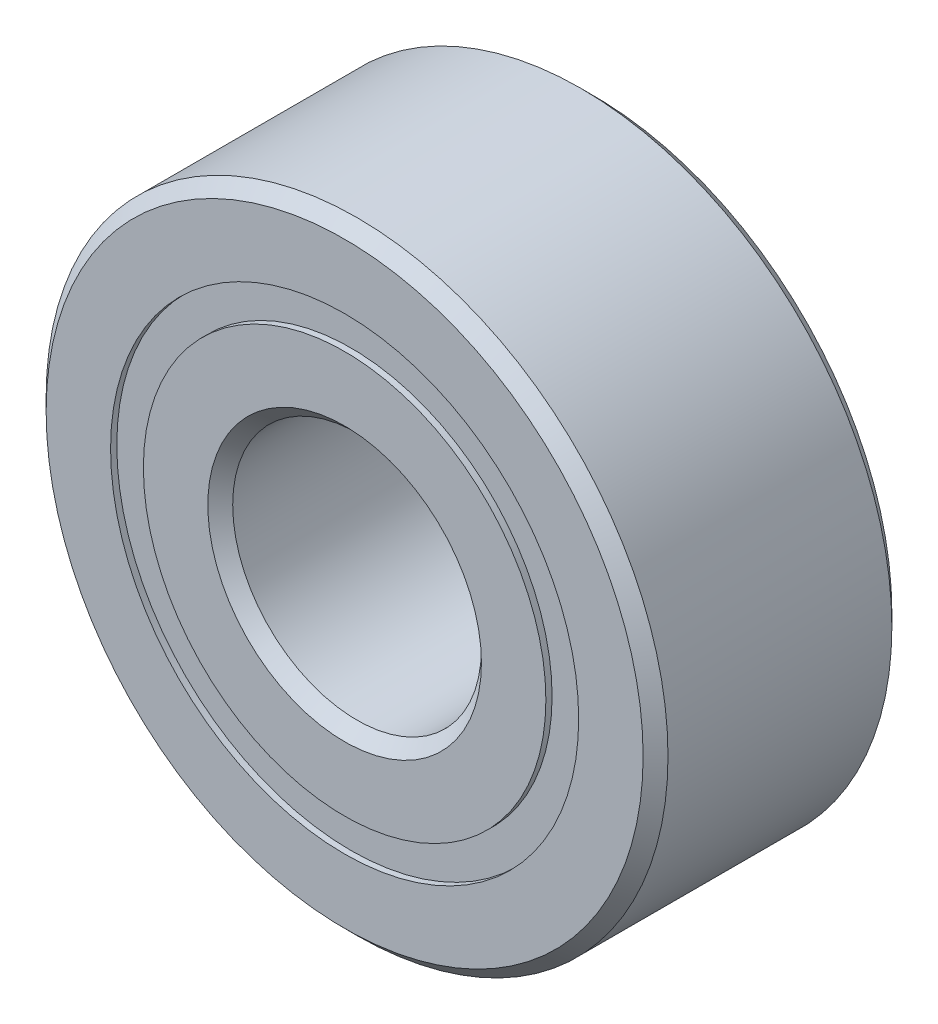
ISO-10303-21;
HEADER;
FILE_DESCRIPTION(('STEP AP214'),'2;1');
FILE_NAME('part.step','',(''),(''),'','','');
FILE_SCHEMA(('AUTOMOTIVE_DESIGN { 1 0 10303 214 1 1 1 1 }'));
ENDSEC;
DATA;
#1=APPLICATION_CONTEXT('core data for automotive mechanical design processes');
#2=APPLICATION_PROTOCOL_DEFINITION('international standard','automotive_design',2000,#1);
#3=PRODUCT_CONTEXT('',#1,'mechanical');
#4=PRODUCT('Part','Part','',(#3));
#5=PRODUCT_RELATED_PRODUCT_CATEGORY('part','',(#4));
#6=PRODUCT_DEFINITION_FORMATION('','',#4);
#7=PRODUCT_DEFINITION_CONTEXT('part definition',#1,'design');
#8=PRODUCT_DEFINITION('design','',#6,#7);
#9=PRODUCT_DEFINITION_SHAPE('','',#8);
#10=(LENGTH_UNIT() NAMED_UNIT(*) SI_UNIT(.MILLI.,.METRE.));
#11=(NAMED_UNIT(*) PLANE_ANGLE_UNIT() SI_UNIT($,.RADIAN.));
#12=(NAMED_UNIT(*) SI_UNIT($,.STERADIAN.) SOLID_ANGLE_UNIT());
#13=UNCERTAINTY_MEASURE_WITH_UNIT(LENGTH_MEASURE(1.E-05),#10,'distance_accuracy_value','');
#14=(GEOMETRIC_REPRESENTATION_CONTEXT(3) GLOBAL_UNCERTAINTY_ASSIGNED_CONTEXT((#13)) GLOBAL_UNIT_ASSIGNED_CONTEXT((#10,
#11,#12)) REPRESENTATION_CONTEXT('',''));
#15=CARTESIAN_POINT('',(0.,0.,0.));
#16=DIRECTION('',(0.,0.,1.));
#17=DIRECTION('',(1.,0.,0.));
#18=AXIS2_PLACEMENT_3D('',#15,#16,#17);
#19=CARTESIAN_POINT('',(0.,3.76373626373626,-1.9));
#20=DIRECTION('',(0.,0.,1.));
#21=DIRECTION('',(1.,0.,0.));
#22=AXIS2_PLACEMENT_3D('',#19,#20,#21);
#23=PLANE('',#22);
#24=CARTESIAN_POINT('',(0.,0.,-1.9));
#25=DIRECTION('',(0.,0.,1.));
#26=DIRECTION('',(1.,0.,0.));
#27=AXIS2_PLACEMENT_3D('',#24,#25,#26);
#28=CIRCLE('',#27,3.76373626373626);
#29=CARTESIAN_POINT('',(3.76373626373626,0.,-1.9));
#30=VERTEX_POINT('',#29);
#31=EDGE_CURVE('E70',#30,#30,#28,.T.);
#32=ORIENTED_EDGE('',*,*,#31,.F.);
#33=EDGE_LOOP('',(#32));
#34=FACE_BOUND('',#33,.T.);
#35=CARTESIAN_POINT('',(0.,0.,-1.9));
#36=DIRECTION('',(0.,0.,1.));
#37=DIRECTION('',(1.,0.,0.));
#38=AXIS2_PLACEMENT_3D('',#35,#36,#37);
#39=CIRCLE('',#38,3.23626373626374);
#40=CARTESIAN_POINT('',(3.23626373626374,0.,-1.9));
#41=VERTEX_POINT('',#40);
#42=EDGE_CURVE('E11',#41,#41,#39,.T.);
#43=ORIENTED_EDGE('',*,*,#42,.T.);
#44=EDGE_LOOP('',(#43));
#45=FACE_BOUND('',#44,.T.);
#46=ADVANCED_FACE('F50',(#34,#45),#23,.F.);
#47=CARTESIAN_POINT('',(0.,0.,2.));
#48=DIRECTION('',(0.,0.,1.));
#49=DIRECTION('',(1.,0.,0.));
#50=AXIS2_PLACEMENT_3D('',#47,#48,#49);
#51=CYLINDRICAL_SURFACE('',#50,3.23626373626374);
#52=ORIENTED_EDGE('',*,*,#42,.F.);
#53=EDGE_LOOP('',(#52));
#54=FACE_BOUND('',#53,.T.);
#55=CARTESIAN_POINT('',(0.,0.,-0.927189448602435));
#56=DIRECTION('',(0.,0.,1.));
#57=DIRECTION('',(1.,0.,0.));
#58=AXIS2_PLACEMENT_3D('',#55,#56,#57);
#59=CIRCLE('',#58,3.23626373626374);
#60=CARTESIAN_POINT('',(3.23626373626374,0.,-0.927189448602435));
#61=VERTEX_POINT('',#60);
#62=EDGE_CURVE('E57',#61,#61,#59,.T.);
#63=ORIENTED_EDGE('',*,*,#62,.T.);
#64=EDGE_LOOP('',(#63));
#65=FACE_BOUND('',#64,.T.);
#66=ADVANCED_FACE('F80',(#54,#65),#51,.F.);
#67=CARTESIAN_POINT('',(0.,3.76373626373626,-0.927189448602435));
#68=DIRECTION('',(0.,0.,-1.));
#69=DIRECTION('',(-1.,0.,0.));
#70=AXIS2_PLACEMENT_3D('',#67,#68,#69);
#71=PLANE('',#70);
#72=ORIENTED_EDGE('',*,*,#62,.F.);
#73=EDGE_LOOP('',(#72));
#74=FACE_BOUND('',#73,.T.);
#75=CARTESIAN_POINT('',(0.,0.,-0.927189448602435));
#76=DIRECTION('',(0.,0.,1.));
#77=DIRECTION('',(1.,0.,0.));
#78=AXIS2_PLACEMENT_3D('',#75,#76,#77);
#79=CIRCLE('',#78,3.76373626373626);
#80=CARTESIAN_POINT('',(3.76373626373626,0.,-0.927189448602435));
#81=VERTEX_POINT('',#80);
#82=EDGE_CURVE('E64',#81,#81,#79,.T.);
#83=ORIENTED_EDGE('',*,*,#82,.T.);
#84=EDGE_LOOP('',(#83));
#85=FACE_BOUND('',#84,.T.);
#86=ADVANCED_FACE('F84',(#74,#85),#71,.F.);
#87=CARTESIAN_POINT('',(0.,0.,2.));
#88=DIRECTION('',(0.,0.,1.));
#89=DIRECTION('',(1.,0.,0.));
#90=AXIS2_PLACEMENT_3D('',#87,#88,#89);
#91=CYLINDRICAL_SURFACE('',#90,3.76373626373626);
#92=ORIENTED_EDGE('',*,*,#82,.F.);
#93=EDGE_LOOP('',(#92));
#94=FACE_BOUND('',#93,.T.);
#95=ORIENTED_EDGE('',*,*,#31,.T.);
#96=EDGE_LOOP('',(#95));
#97=FACE_BOUND('',#96,.T.);
#98=ADVANCED_FACE('F77',(#94,#97),#91,.T.);
#99=CLOSED_SHELL('',(#46,#66,#86,#98));
#100=MANIFOLD_SOLID_BREP('B2',#99);
#101=CARTESIAN_POINT('',(0.,3.76373626373626,1.9));
#102=DIRECTION('',(0.,0.,-1.));
#103=DIRECTION('',(-1.,0.,0.));
#104=AXIS2_PLACEMENT_3D('',#101,#102,#103);
#105=PLANE('',#104);
#106=CARTESIAN_POINT('',(0.,0.,1.9));
#107=DIRECTION('',(0.,0.,1.));
#108=DIRECTION('',(1.,0.,0.));
#109=AXIS2_PLACEMENT_3D('',#106,#107,#108);
#110=CIRCLE('',#109,3.23626373626374);
#111=CARTESIAN_POINT('',(3.23626373626374,0.,1.9));
#112=VERTEX_POINT('',#111);
#113=EDGE_CURVE('E49',#112,#112,#110,.T.);
#114=ORIENTED_EDGE('',*,*,#113,.F.);
#115=EDGE_LOOP('',(#114));
#116=FACE_BOUND('',#115,.T.);
#117=CARTESIAN_POINT('',(0.,0.,1.9));
#118=DIRECTION('',(0.,0.,1.));
#119=DIRECTION('',(1.,0.,0.));
#120=AXIS2_PLACEMENT_3D('',#117,#118,#119);
#121=CIRCLE('',#120,3.76373626373626);
#122=CARTESIAN_POINT('',(3.76373626373626,0.,1.9));
#123=VERTEX_POINT('',#122);
#124=EDGE_CURVE('E146',#123,#123,#121,.T.);
#125=ORIENTED_EDGE('',*,*,#124,.T.);
#126=EDGE_LOOP('',(#125));
#127=FACE_BOUND('',#126,.T.);
#128=ADVANCED_FACE('F126',(#116,#127),#105,.F.);
#129=CARTESIAN_POINT('',(0.,0.,2.));
#130=DIRECTION('',(0.,0.,1.));
#131=DIRECTION('',(1.,0.,0.));
#132=AXIS2_PLACEMENT_3D('',#129,#130,#131);
#133=CYLINDRICAL_SURFACE('',#132,3.23626373626374);
#134=CARTESIAN_POINT('',(0.,0.,0.927189448602435));
#135=DIRECTION('',(0.,0.,1.));
#136=DIRECTION('',(1.,0.,0.));
#137=AXIS2_PLACEMENT_3D('',#134,#135,#136);
#138=CIRCLE('',#137,3.23626373626374);
#139=CARTESIAN_POINT('',(3.23626373626374,0.,0.927189448602435));
#140=VERTEX_POINT('',#139);
#141=EDGE_CURVE('E133',#140,#140,#138,.T.);
#142=ORIENTED_EDGE('',*,*,#141,.F.);
#143=EDGE_LOOP('',(#142));
#144=FACE_BOUND('',#143,.T.);
#145=ORIENTED_EDGE('',*,*,#113,.T.);
#146=EDGE_LOOP('',(#145));
#147=FACE_BOUND('',#146,.T.);
#148=ADVANCED_FACE('F162',(#144,#147),#133,.F.);
#149=CARTESIAN_POINT('',(0.,3.76373626373626,0.927189448602435));
#150=DIRECTION('',(0.,0.,1.));
#151=DIRECTION('',(1.,0.,0.));
#152=AXIS2_PLACEMENT_3D('',#149,#150,#151);
#153=PLANE('',#152);
#154=CARTESIAN_POINT('',(0.,0.,0.927189448602435));
#155=DIRECTION('',(0.,0.,1.));
#156=DIRECTION('',(1.,0.,0.));
#157=AXIS2_PLACEMENT_3D('',#154,#155,#156);
#158=CIRCLE('',#157,3.76373626373626);
#159=CARTESIAN_POINT('',(3.76373626373626,0.,0.927189448602435));
#160=VERTEX_POINT('',#159);
#161=EDGE_CURVE('E140',#160,#160,#158,.T.);
#162=ORIENTED_EDGE('',*,*,#161,.F.);
#163=EDGE_LOOP('',(#162));
#164=FACE_BOUND('',#163,.T.);
#165=ORIENTED_EDGE('',*,*,#141,.T.);
#166=EDGE_LOOP('',(#165));
#167=FACE_BOUND('',#166,.T.);
#168=ADVANCED_FACE('F157',(#164,#167),#153,.F.);
#169=CARTESIAN_POINT('',(0.,0.,2.));
#170=DIRECTION('',(0.,0.,1.));
#171=DIRECTION('',(1.,0.,0.));
#172=AXIS2_PLACEMENT_3D('',#169,#170,#171);
#173=CYLINDRICAL_SURFACE('',#172,3.76373626373626);
#174=ORIENTED_EDGE('',*,*,#124,.F.);
#175=EDGE_LOOP('',(#174));
#176=FACE_BOUND('',#175,.T.);
#177=ORIENTED_EDGE('',*,*,#161,.T.);
#178=EDGE_LOOP('',(#177));
#179=FACE_BOUND('',#178,.T.);
#180=ADVANCED_FACE('F154',(#176,#179),#173,.T.);
#181=CLOSED_SHELL('',(#128,#148,#168,#180));
#182=MANIFOLD_SOLID_BREP('B6',#181);
#183=CARTESIAN_POINT('',(-1.74999999999996,3.03108891324556,0.));
#184=DIRECTION('',(0.,0.,1.));
#185=DIRECTION('',(-0.499999999999989,0.866025403784445,0.));
#186=AXIS2_PLACEMENT_3D('',#183,#184,#185);
#187=SPHERICAL_SURFACE('',#186,0.927189448602435);
#188=CARTESIAN_POINT('',(-1.74999999999996,3.03108891324556,0.927189448602435));
#189=VERTEX_POINT('',#188);
#190=VERTEX_LOOP('',#189);
#191=FACE_BOUND('',#190,.T.);
#192=ADVANCED_FACE('F202',(#191),#187,.T.);
#193=CLOSED_SHELL('',(#192));
#194=MANIFOLD_SOLID_BREP('B44',#193);
#195=CARTESIAN_POINT('',(-3.03108891324552,1.75000000000004,0.));
#196=DIRECTION('',(0.,0.,1.));
#197=DIRECTION('',(-0.866025403784433,0.50000000000001,0.));
#198=AXIS2_PLACEMENT_3D('',#195,#196,#197);
#199=SPHERICAL_SURFACE('',#198,0.927189448602435);
#200=CARTESIAN_POINT('',(-3.03108891324552,1.75000000000004,0.927189448602435));
#201=VERTEX_POINT('',#200);
#202=VERTEX_LOOP('',#201);
#203=FACE_BOUND('',#202,.T.);
#204=ADVANCED_FACE('F223',(#203),#199,.T.);
#205=CLOSED_SHELL('',(#204));
#206=MANIFOLD_SOLID_BREP('B122',#205);
#207=CARTESIAN_POINT('',(-3.5,0.,0.));
#208=DIRECTION('',(0.,0.,1.));
#209=DIRECTION('',(-1.,0.,0.));
#210=AXIS2_PLACEMENT_3D('',#207,#208,#209);
#211=SPHERICAL_SURFACE('',#210,0.927189448602435);
#212=CARTESIAN_POINT('',(-3.5,0.,0.927189448602435));
#213=VERTEX_POINT('',#212);
#214=VERTEX_LOOP('',#213);
#215=FACE_BOUND('',#214,.T.);
#216=ADVANCED_FACE('F244',(#215),#211,.T.);
#217=CLOSED_SHELL('',(#216));
#218=MANIFOLD_SOLID_BREP('B198',#217);
#219=CARTESIAN_POINT('',(-3.03108891324555,-1.74999999999997,0.));
#220=DIRECTION('',(0.,0.,1.));
#221=DIRECTION('',(-0.866025403784443,-0.499999999999992,0.));
#222=AXIS2_PLACEMENT_3D('',#219,#220,#221);
#223=SPHERICAL_SURFACE('',#222,0.927189448602435);
#224=CARTESIAN_POINT('',(-3.03108891324555,-1.74999999999997,0.927189448602435));
#225=VERTEX_POINT('',#224);
#226=VERTEX_LOOP('',#225);
#227=FACE_BOUND('',#226,.T.);
#228=ADVANCED_FACE('F265',(#227),#223,.T.);
#229=CLOSED_SHELL('',(#228));
#230=MANIFOLD_SOLID_BREP('B219',#229);
#231=CARTESIAN_POINT('',(-1.75000000000002,-3.03108891324552,0.));
#232=DIRECTION('',(0.,0.,1.));
#233=DIRECTION('',(-0.500000000000007,-0.866025403784435,0.));
#234=AXIS2_PLACEMENT_3D('',#231,#232,#233);
#235=SPHERICAL_SURFACE('',#234,0.927189448602435);
#236=CARTESIAN_POINT('',(-1.75000000000002,-3.03108891324552,0.927189448602435));
#237=VERTEX_POINT('',#236);
#238=VERTEX_LOOP('',#237);
#239=FACE_BOUND('',#238,.T.);
#240=ADVANCED_FACE('F286',(#239),#235,.T.);
#241=CLOSED_SHELL('',(#240));
#242=MANIFOLD_SOLID_BREP('B240',#241);
#243=CARTESIAN_POINT('',(0.,-3.5,0.));
#244=DIRECTION('',(0.,0.,1.));
#245=DIRECTION('',(0.,-1.,0.));
#246=AXIS2_PLACEMENT_3D('',#243,#244,#245);
#247=SPHERICAL_SURFACE('',#246,0.927189448602435);
#248=CARTESIAN_POINT('',(0.,-3.5,0.927189448602435));
#249=VERTEX_POINT('',#248);
#250=VERTEX_LOOP('',#249);
#251=FACE_BOUND('',#250,.T.);
#252=ADVANCED_FACE('F307',(#251),#247,.T.);
#253=CLOSED_SHELL('',(#252));
#254=MANIFOLD_SOLID_BREP('B261',#253);
#255=CARTESIAN_POINT('',(1.74999999999998,-3.03108891324555,0.));
#256=DIRECTION('',(0.,0.,1.));
#257=DIRECTION('',(0.499999999999995,-0.866025403784442,0.));
#258=AXIS2_PLACEMENT_3D('',#255,#256,#257);
#259=SPHERICAL_SURFACE('',#258,0.927189448602435);
#260=CARTESIAN_POINT('',(1.74999999999998,-3.03108891324555,0.927189448602435));
#261=VERTEX_POINT('',#260);
#262=VERTEX_LOOP('',#261);
#263=FACE_BOUND('',#262,.T.);
#264=ADVANCED_FACE('F328',(#263),#259,.T.);
#265=CLOSED_SHELL('',(#264));
#266=MANIFOLD_SOLID_BREP('B282',#265);
#267=CARTESIAN_POINT('',(3.03108891324553,-1.75000000000001,0.));
#268=DIRECTION('',(0.,0.,1.));
#269=DIRECTION('',(0.866025403784436,-0.500000000000004,0.));
#270=AXIS2_PLACEMENT_3D('',#267,#268,#269);
#271=SPHERICAL_SURFACE('',#270,0.927189448602435);
#272=CARTESIAN_POINT('',(3.03108891324553,-1.75000000000001,0.927189448602435));
#273=VERTEX_POINT('',#272);
#274=VERTEX_LOOP('',#273);
#275=FACE_BOUND('',#274,.T.);
#276=ADVANCED_FACE('F349',(#275),#271,.T.);
#277=CLOSED_SHELL('',(#276));
#278=MANIFOLD_SOLID_BREP('B303',#277);
#279=CARTESIAN_POINT('',(3.5,0.,0.));
#280=DIRECTION('',(0.,0.,1.));
#281=DIRECTION('',(1.,0.,0.));
#282=AXIS2_PLACEMENT_3D('',#279,#280,#281);
#283=SPHERICAL_SURFACE('',#282,0.927189448602435);
#284=CARTESIAN_POINT('',(3.5,0.,0.927189448602435));
#285=VERTEX_POINT('',#284);
#286=VERTEX_LOOP('',#285);
#287=FACE_BOUND('',#286,.T.);
#288=ADVANCED_FACE('F370',(#287),#283,.T.);
#289=CLOSED_SHELL('',(#288));
#290=MANIFOLD_SOLID_BREP('B324',#289);
#291=CARTESIAN_POINT('',(3.03108891324554,1.74999999999999,0.));
#292=DIRECTION('',(0.,0.,1.));
#293=DIRECTION('',(0.86602540378444,0.499999999999998,0.));
#294=AXIS2_PLACEMENT_3D('',#291,#292,#293);
#295=SPHERICAL_SURFACE('',#294,0.927189448602435);
#296=CARTESIAN_POINT('',(3.03108891324554,1.74999999999999,0.927189448602435));
#297=VERTEX_POINT('',#296);
#298=VERTEX_LOOP('',#297);
#299=FACE_BOUND('',#298,.T.);
#300=ADVANCED_FACE('F391',(#299),#295,.T.);
#301=CLOSED_SHELL('',(#300));
#302=MANIFOLD_SOLID_BREP('B345',#301);
#303=CARTESIAN_POINT('',(1.75,3.03108891324553,0.));
#304=DIRECTION('',(0.,0.,1.));
#305=DIRECTION('',(0.500000000000001,0.866025403784438,0.));
#306=AXIS2_PLACEMENT_3D('',#303,#304,#305);
#307=SPHERICAL_SURFACE('',#306,0.927189448602435);
#308=CARTESIAN_POINT('',(1.75,3.03108891324553,0.927189448602435));
#309=VERTEX_POINT('',#308);
#310=VERTEX_LOOP('',#309);
#311=FACE_BOUND('',#310,.T.);
#312=ADVANCED_FACE('F412',(#311),#307,.T.);
#313=CLOSED_SHELL('',(#312));
#314=MANIFOLD_SOLID_BREP('B366',#313);
#315=CARTESIAN_POINT('',(0.,3.5,0.));
#316=DIRECTION('',(0.,0.,1.));
#317=DIRECTION('',(0.,1.,0.));
#318=AXIS2_PLACEMENT_3D('',#315,#316,#317);
#319=SPHERICAL_SURFACE('',#318,0.927189448602435);
#320=CARTESIAN_POINT('',(0.,3.5,0.927189448602435));
#321=VERTEX_POINT('',#320);
#322=VERTEX_LOOP('',#321);
#323=FACE_BOUND('',#322,.T.);
#324=ADVANCED_FACE('F435',(#323),#319,.T.);
#325=CLOSED_SHELL('',(#324));
#326=MANIFOLD_SOLID_BREP('B387',#325);
#327=CARTESIAN_POINT('',(0.,3.23626373626374,2.));
#328=DIRECTION('',(0.,0.,-1.));
#329=DIRECTION('',(-1.,0.,0.));
#330=AXIS2_PLACEMENT_3D('',#327,#328,#329);
#331=PLANE('',#330);
#332=CARTESIAN_POINT('',(0.,0.,2.));
#333=DIRECTION('',(0.,0.,1.));
#334=DIRECTION('',(1.,0.,0.));
#335=AXIS2_PLACEMENT_3D('',#332,#333,#334);
#336=CIRCLE('',#335,2.2);
#337=CARTESIAN_POINT('',(2.2,0.,2.));
#338=VERTEX_POINT('',#337);
#339=EDGE_CURVE('E493',#338,#338,#336,.T.);
#340=ORIENTED_EDGE('',*,*,#339,.F.);
#341=EDGE_LOOP('',(#340));
#342=FACE_BOUND('',#341,.T.);
#343=CARTESIAN_POINT('',(0.,0.,2.));
#344=DIRECTION('',(0.,0.,1.));
#345=DIRECTION('',(1.,0.,0.));
#346=AXIS2_PLACEMENT_3D('',#343,#344,#345);
#347=CIRCLE('',#346,3.23626373626374);
#348=CARTESIAN_POINT('',(3.23626373626374,0.,2.));
#349=VERTEX_POINT('',#348);
#350=EDGE_CURVE('E434',#349,#349,#347,.T.);
#351=ORIENTED_EDGE('',*,*,#350,.T.);
#352=EDGE_LOOP('',(#351));
#353=FACE_BOUND('',#352,.T.);
#354=ADVANCED_FACE('F455',(#342,#353),#331,.F.);
#355=CARTESIAN_POINT('',(0.,0.,2.));
#356=DIRECTION('',(0.,0.,1.));
#357=DIRECTION('',(1.,0.,0.));
#358=AXIS2_PLACEMENT_3D('',#355,#356,#357);
#359=CYLINDRICAL_SURFACE('',#358,3.23626373626374);
#360=ORIENTED_EDGE('',*,*,#350,.F.);
#361=EDGE_LOOP('',(#360));
#362=FACE_BOUND('',#361,.T.);
#363=CARTESIAN_POINT('',(0.,0.,0.888888888888889));
#364=DIRECTION('',(0.,0.,1.));
#365=DIRECTION('',(1.,0.,0.));
#366=AXIS2_PLACEMENT_3D('',#363,#364,#365);
#367=CIRCLE('',#366,3.23626373626374);
#368=CARTESIAN_POINT('',(3.23626373626374,0.,0.888888888888889));
#369=VERTEX_POINT('',#368);
#370=EDGE_CURVE('E462',#369,#369,#367,.T.);
#371=ORIENTED_EDGE('',*,*,#370,.T.);
#372=EDGE_LOOP('',(#371));
#373=FACE_BOUND('',#372,.T.);
#374=ADVANCED_FACE('F501',(#362,#373),#359,.T.);
#375=CARTESIAN_POINT('',(0.,0.,0.));
#376=DIRECTION('',(0.,0.,1.));
#377=DIRECTION('',(1.,0.,0.));
#378=AXIS2_PLACEMENT_3D('',#375,#376,#377);
#379=TOROIDAL_SURFACE('',#378,3.5,0.927189448602434);
#380=ORIENTED_EDGE('',*,*,#370,.F.);
#381=EDGE_LOOP('',(#380));
#382=FACE_BOUND('',#381,.T.);
#383=CARTESIAN_POINT('',(0.,0.,-0.88888888888889));
#384=DIRECTION('',(0.,0.,1.));
#385=DIRECTION('',(1.,0.,0.));
#386=AXIS2_PLACEMENT_3D('',#383,#384,#385);
#387=CIRCLE('',#386,3.23626373626374);
#388=CARTESIAN_POINT('',(3.23626373626374,0.,-0.88888888888889));
#389=VERTEX_POINT('',#388);
#390=EDGE_CURVE('E469',#389,#389,#387,.T.);
#391=ORIENTED_EDGE('',*,*,#390,.T.);
#392=EDGE_LOOP('',(#391));
#393=FACE_BOUND('',#392,.T.);
#394=ADVANCED_FACE('F505',(#382,#393),#379,.F.);
#395=CARTESIAN_POINT('',(0.,0.,2.));
#396=DIRECTION('',(0.,0.,1.));
#397=DIRECTION('',(1.,0.,0.));
#398=AXIS2_PLACEMENT_3D('',#395,#396,#397);
#399=CYLINDRICAL_SURFACE('',#398,3.23626373626374);
#400=ORIENTED_EDGE('',*,*,#390,.F.);
#401=EDGE_LOOP('',(#400));
#402=FACE_BOUND('',#401,.T.);
#403=CARTESIAN_POINT('',(0.,0.,-2.));
#404=DIRECTION('',(0.,0.,1.));
#405=DIRECTION('',(1.,0.,0.));
#406=AXIS2_PLACEMENT_3D('',#403,#404,#405);
#407=CIRCLE('',#406,3.23626373626374);
#408=CARTESIAN_POINT('',(3.23626373626374,0.,-2.));
#409=VERTEX_POINT('',#408);
#410=EDGE_CURVE('E475',#409,#409,#407,.T.);
#411=ORIENTED_EDGE('',*,*,#410,.T.);
#412=EDGE_LOOP('',(#411));
#413=FACE_BOUND('',#412,.T.);
#414=ADVANCED_FACE('F510',(#402,#413),#399,.T.);
#415=CARTESIAN_POINT('',(0.,2.2,-2.));
#416=DIRECTION('',(0.,0.,1.));
#417=DIRECTION('',(1.,0.,0.));
#418=AXIS2_PLACEMENT_3D('',#415,#416,#417);
#419=PLANE('',#418);
#420=ORIENTED_EDGE('',*,*,#410,.F.);
#421=EDGE_LOOP('',(#420));
#422=FACE_BOUND('',#421,.T.);
#423=CARTESIAN_POINT('',(0.,0.,-2.));
#424=DIRECTION('',(0.,0.,1.));
#425=DIRECTION('',(1.,0.,0.));
#426=AXIS2_PLACEMENT_3D('',#423,#424,#425);
#427=CIRCLE('',#426,2.2);
#428=CARTESIAN_POINT('',(2.2,0.,-2.));
#429=VERTEX_POINT('',#428);
#430=EDGE_CURVE('E481',#429,#429,#427,.T.);
#431=ORIENTED_EDGE('',*,*,#430,.T.);
#432=EDGE_LOOP('',(#431));
#433=FACE_BOUND('',#432,.T.);
#434=ADVANCED_FACE('F516',(#422,#433),#419,.F.);
#435=CARTESIAN_POINT('',(0.,0.,-1.8));
#436=DIRECTION('',(0.,0.,-1.));
#437=DIRECTION('',(-1.,0.,0.));
#438=AXIS2_PLACEMENT_3D('',#435,#436,#437);
#439=CONICAL_SURFACE('',#438,2.,0.785398163397443);
#440=ORIENTED_EDGE('',*,*,#430,.F.);
#441=EDGE_LOOP('',(#440));
#442=FACE_BOUND('',#441,.T.);
#443=CARTESIAN_POINT('',(0.,0.,-1.8));
#444=DIRECTION('',(0.,0.,1.));
#445=DIRECTION('',(1.,0.,0.));
#446=AXIS2_PLACEMENT_3D('',#443,#444,#445);
#447=CIRCLE('',#446,2.);
#448=CARTESIAN_POINT('',(2.,0.,-1.8));
#449=VERTEX_POINT('',#448);
#450=EDGE_CURVE('E485',#449,#449,#447,.T.);
#451=ORIENTED_EDGE('',*,*,#450,.T.);
#452=EDGE_LOOP('',(#451));
#453=FACE_BOUND('',#452,.T.);
#454=ADVANCED_FACE('F520',(#442,#453),#439,.F.);
#455=CARTESIAN_POINT('',(0.,0.,2.));
#456=DIRECTION('',(0.,0.,1.));
#457=DIRECTION('',(1.,0.,0.));
#458=AXIS2_PLACEMENT_3D('',#455,#456,#457);
#459=CYLINDRICAL_SURFACE('',#458,2.);
#460=ORIENTED_EDGE('',*,*,#450,.F.);
#461=EDGE_LOOP('',(#460));
#462=FACE_BOUND('',#461,.T.);
#463=CARTESIAN_POINT('',(0.,0.,1.8));
#464=DIRECTION('',(0.,0.,1.));
#465=DIRECTION('',(1.,0.,0.));
#466=AXIS2_PLACEMENT_3D('',#463,#464,#465);
#467=CIRCLE('',#466,2.);
#468=CARTESIAN_POINT('',(2.,0.,1.8));
#469=VERTEX_POINT('',#468);
#470=EDGE_CURVE('E489',#469,#469,#467,.T.);
#471=ORIENTED_EDGE('',*,*,#470,.T.);
#472=EDGE_LOOP('',(#471));
#473=FACE_BOUND('',#472,.T.);
#474=ADVANCED_FACE('F524',(#462,#473),#459,.F.);
#475=CARTESIAN_POINT('',(0.,0.,2.));
#476=DIRECTION('',(0.,0.,1.));
#477=DIRECTION('',(1.,0.,0.));
#478=AXIS2_PLACEMENT_3D('',#475,#476,#477);
#479=CONICAL_SURFACE('',#478,2.2,0.785398163397454);
#480=ORIENTED_EDGE('',*,*,#470,.F.);
#481=EDGE_LOOP('',(#480));
#482=FACE_BOUND('',#481,.T.);
#483=ORIENTED_EDGE('',*,*,#339,.T.);
#484=EDGE_LOOP('',(#483));
#485=FACE_BOUND('',#484,.T.);
#486=ADVANCED_FACE('F498',(#482,#485),#479,.F.);
#487=CLOSED_SHELL('',(#354,#374,#394,#414,#434,#454,#474,#486));
#488=MANIFOLD_SOLID_BREP('B408',#487);
#489=CARTESIAN_POINT('',(0.,0.,1.8));
#490=DIRECTION('',(0.,0.,-1.));
#491=DIRECTION('',(-1.,0.,0.));
#492=AXIS2_PLACEMENT_3D('',#489,#490,#491);
#493=CONICAL_SURFACE('',#492,5.,0.785398163397445);
#494=CARTESIAN_POINT('',(0.,0.,2.));
#495=DIRECTION('',(0.,0.,1.));
#496=DIRECTION('',(1.,0.,0.));
#497=AXIS2_PLACEMENT_3D('',#494,#495,#496);
#498=CIRCLE('',#497,4.8);
#499=CARTESIAN_POINT('',(4.8,0.,2.));
#500=VERTEX_POINT('',#499);
#501=EDGE_CURVE('E631',#500,#500,#498,.T.);
#502=ORIENTED_EDGE('',*,*,#501,.F.);
#503=EDGE_LOOP('',(#502));
#504=FACE_BOUND('',#503,.T.);
#505=CARTESIAN_POINT('',(0.,0.,1.8));
#506=DIRECTION('',(0.,0.,1.));
#507=DIRECTION('',(1.,0.,0.));
#508=AXIS2_PLACEMENT_3D('',#505,#506,#507);
#509=CIRCLE('',#508,5.);
#510=CARTESIAN_POINT('',(5.,0.,1.8));
#511=VERTEX_POINT('',#510);
#512=EDGE_CURVE('E454',#511,#511,#509,.T.);
#513=ORIENTED_EDGE('',*,*,#512,.T.);
#514=EDGE_LOOP('',(#513));
#515=FACE_BOUND('',#514,.T.);
#516=ADVANCED_FACE('F593',(#504,#515),#493,.T.);
#517=CARTESIAN_POINT('',(0.,0.,2.));
#518=DIRECTION('',(0.,0.,1.));
#519=DIRECTION('',(1.,0.,0.));
#520=AXIS2_PLACEMENT_3D('',#517,#518,#519);
#521=CYLINDRICAL_SURFACE('',#520,5.);
#522=ORIENTED_EDGE('',*,*,#512,.F.);
#523=EDGE_LOOP('',(#522));
#524=FACE_BOUND('',#523,.T.);
#525=CARTESIAN_POINT('',(0.,0.,-1.8));
#526=DIRECTION('',(0.,0.,1.));
#527=DIRECTION('',(1.,0.,0.));
#528=AXIS2_PLACEMENT_3D('',#525,#526,#527);
#529=CIRCLE('',#528,5.);
#530=CARTESIAN_POINT('',(5.,0.,-1.8));
#531=VERTEX_POINT('',#530);
#532=EDGE_CURVE('E600',#531,#531,#529,.T.);
#533=ORIENTED_EDGE('',*,*,#532,.T.);
#534=EDGE_LOOP('',(#533));
#535=FACE_BOUND('',#534,.T.);
#536=ADVANCED_FACE('F639',(#524,#535),#521,.T.);
#537=CARTESIAN_POINT('',(0.,0.,-2.));
#538=DIRECTION('',(0.,0.,1.));
#539=DIRECTION('',(1.,0.,0.));
#540=AXIS2_PLACEMENT_3D('',#537,#538,#539);
#541=CONICAL_SURFACE('',#540,4.8,0.785398163397444);
#542=ORIENTED_EDGE('',*,*,#532,.F.);
#543=EDGE_LOOP('',(#542));
#544=FACE_BOUND('',#543,.T.);
#545=CARTESIAN_POINT('',(0.,0.,-2.));
#546=DIRECTION('',(0.,0.,1.));
#547=DIRECTION('',(1.,0.,0.));
#548=AXIS2_PLACEMENT_3D('',#545,#546,#547);
#549=CIRCLE('',#548,4.8);
#550=CARTESIAN_POINT('',(4.8,0.,-2.));
#551=VERTEX_POINT('',#550);
#552=EDGE_CURVE('E607',#551,#551,#549,.T.);
#553=ORIENTED_EDGE('',*,*,#552,.T.);
#554=EDGE_LOOP('',(#553));
#555=FACE_BOUND('',#554,.T.);
#556=ADVANCED_FACE('F643',(#544,#555),#541,.T.);
#557=CARTESIAN_POINT('',(0.,4.8,-2.));
#558=DIRECTION('',(0.,0.,1.));
#559=DIRECTION('',(1.,0.,0.));
#560=AXIS2_PLACEMENT_3D('',#557,#558,#559);
#561=PLANE('',#560);
#562=ORIENTED_EDGE('',*,*,#552,.F.);
#563=EDGE_LOOP('',(#562));
#564=FACE_BOUND('',#563,.T.);
#565=CARTESIAN_POINT('',(0.,0.,-2.));
#566=DIRECTION('',(0.,0.,1.));
#567=DIRECTION('',(1.,0.,0.));
#568=AXIS2_PLACEMENT_3D('',#565,#566,#567);
#569=CIRCLE('',#568,3.76373626373626);
#570=CARTESIAN_POINT('',(3.76373626373626,0.,-2.));
#571=VERTEX_POINT('',#570);
#572=EDGE_CURVE('E613',#571,#571,#569,.T.);
#573=ORIENTED_EDGE('',*,*,#572,.T.);
#574=EDGE_LOOP('',(#573));
#575=FACE_BOUND('',#574,.T.);
#576=ADVANCED_FACE('F648',(#564,#575),#561,.F.);
#577=CARTESIAN_POINT('',(0.,0.,2.));
#578=DIRECTION('',(0.,0.,1.));
#579=DIRECTION('',(1.,0.,0.));
#580=AXIS2_PLACEMENT_3D('',#577,#578,#579);
#581=CYLINDRICAL_SURFACE('',#580,3.76373626373626);
#582=ORIENTED_EDGE('',*,*,#572,.F.);
#583=EDGE_LOOP('',(#582));
#584=FACE_BOUND('',#583,.T.);
#585=CARTESIAN_POINT('',(0.,0.,-0.888888888888889));
#586=DIRECTION('',(0.,0.,1.));
#587=DIRECTION('',(1.,0.,0.));
#588=AXIS2_PLACEMENT_3D('',#585,#586,#587);
#589=CIRCLE('',#588,3.76373626373626);
#590=CARTESIAN_POINT('',(3.76373626373626,0.,-0.888888888888889));
#591=VERTEX_POINT('',#590);
#592=EDGE_CURVE('E619',#591,#591,#589,.T.);
#593=ORIENTED_EDGE('',*,*,#592,.T.);
#594=EDGE_LOOP('',(#593));
#595=FACE_BOUND('',#594,.T.);
#596=ADVANCED_FACE('F654',(#584,#595),#581,.F.);
#597=CARTESIAN_POINT('',(0.,0.,0.));
#598=DIRECTION('',(0.,0.,1.));
#599=DIRECTION('',(1.,0.,0.));
#600=AXIS2_PLACEMENT_3D('',#597,#598,#599);
#601=TOROIDAL_SURFACE('',#600,3.5,0.927189448602435);
#602=ORIENTED_EDGE('',*,*,#592,.F.);
#603=EDGE_LOOP('',(#602));
#604=FACE_BOUND('',#603,.T.);
#605=CARTESIAN_POINT('',(0.,0.,0.888888888888889));
#606=DIRECTION('',(0.,0.,1.));
#607=DIRECTION('',(1.,0.,0.));
#608=AXIS2_PLACEMENT_3D('',#605,#606,#607);
#609=CIRCLE('',#608,3.76373626373626);
#610=CARTESIAN_POINT('',(3.76373626373626,0.,0.888888888888889));
#611=VERTEX_POINT('',#610);
#612=EDGE_CURVE('E623',#611,#611,#609,.T.);
#613=ORIENTED_EDGE('',*,*,#612,.T.);
#614=EDGE_LOOP('',(#613));
#615=FACE_BOUND('',#614,.T.);
#616=ADVANCED_FACE('F658',(#604,#615),#601,.F.);
#617=CARTESIAN_POINT('',(0.,0.,2.));
#618=DIRECTION('',(0.,0.,1.));
#619=DIRECTION('',(1.,0.,0.));
#620=AXIS2_PLACEMENT_3D('',#617,#618,#619);
#621=CYLINDRICAL_SURFACE('',#620,3.76373626373626);
#622=ORIENTED_EDGE('',*,*,#612,.F.);
#623=EDGE_LOOP('',(#622));
#624=FACE_BOUND('',#623,.T.);
#625=CARTESIAN_POINT('',(0.,0.,2.));
#626=DIRECTION('',(0.,0.,1.));
#627=DIRECTION('',(1.,0.,0.));
#628=AXIS2_PLACEMENT_3D('',#625,#626,#627);
#629=CIRCLE('',#628,3.76373626373626);
#630=CARTESIAN_POINT('',(3.76373626373626,0.,2.));
#631=VERTEX_POINT('',#630);
#632=EDGE_CURVE('E627',#631,#631,#629,.T.);
#633=ORIENTED_EDGE('',*,*,#632,.T.);
#634=EDGE_LOOP('',(#633));
#635=FACE_BOUND('',#634,.T.);
#636=ADVANCED_FACE('F662',(#624,#635),#621,.F.);
#637=CARTESIAN_POINT('',(0.,4.8,2.));
#638=DIRECTION('',(0.,0.,-1.));
#639=DIRECTION('',(-1.,0.,0.));
#640=AXIS2_PLACEMENT_3D('',#637,#638,#639);
#641=PLANE('',#640);
#642=ORIENTED_EDGE('',*,*,#632,.F.);
#643=EDGE_LOOP('',(#642));
#644=FACE_BOUND('',#643,.T.);
#645=ORIENTED_EDGE('',*,*,#501,.T.);
#646=EDGE_LOOP('',(#645));
#647=FACE_BOUND('',#646,.T.);
#648=ADVANCED_FACE('F636',(#644,#647),#641,.F.);
#649=CLOSED_SHELL('',(#516,#536,#556,#576,#596,#616,#636,#648));
#650=MANIFOLD_SOLID_BREP('B429',#649);
#651=ADVANCED_BREP_SHAPE_REPRESENTATION('',(#18,#100,#182,#194,#206,#218,#230,#242,#254,#266,
#278,#290,#302,#314,#326,#488,#650),#14);
#652=SHAPE_DEFINITION_REPRESENTATION(#9,#651);
ENDSEC;
END-ISO-10303-21;
